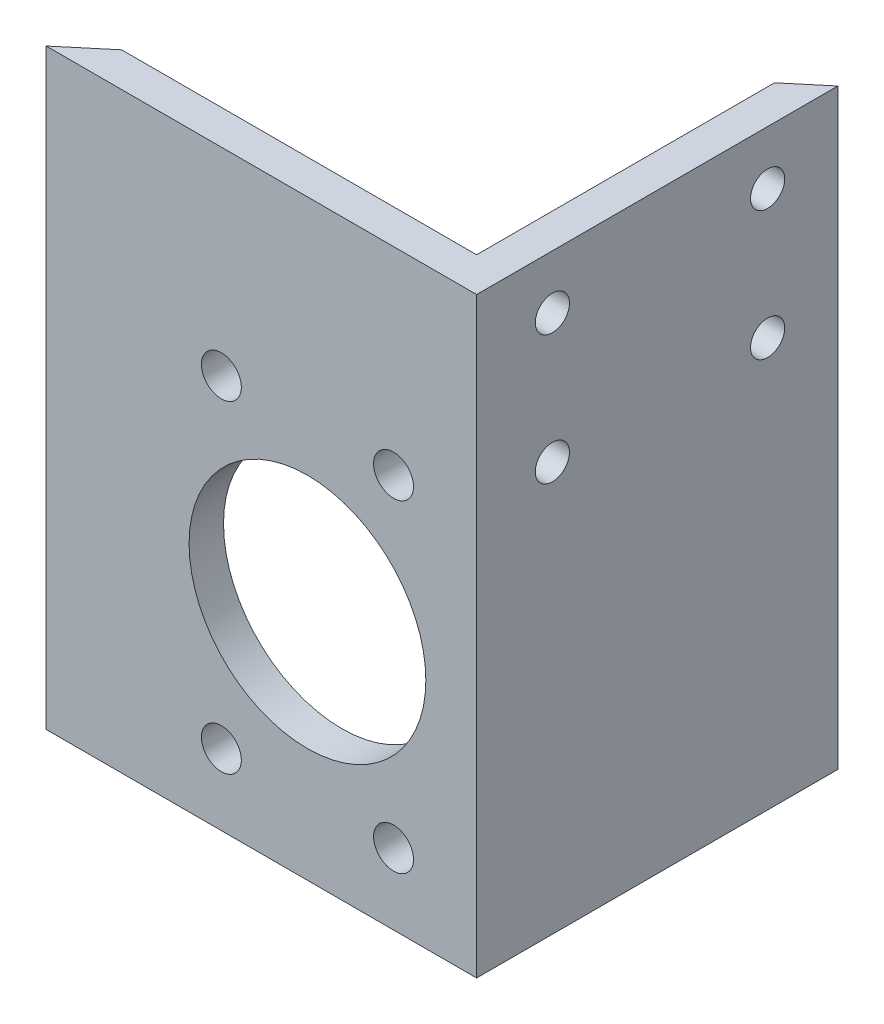
ISO-10303-21;
HEADER;
FILE_DESCRIPTION(('STEP AP214'),'2;1');
FILE_NAME('part.step','',(''),(''),'','','');
FILE_SCHEMA(('AUTOMOTIVE_DESIGN { 1 0 10303 214 1 1 1 1 }'));
ENDSEC;
DATA;
#1=APPLICATION_CONTEXT('core data for automotive mechanical design processes');
#2=APPLICATION_PROTOCOL_DEFINITION('international standard','automotive_design',2000,#1);
#3=PRODUCT_CONTEXT('',#1,'mechanical');
#4=PRODUCT('Part','Part','',(#3));
#5=PRODUCT_RELATED_PRODUCT_CATEGORY('part','',(#4));
#6=PRODUCT_DEFINITION_FORMATION('','',#4);
#7=PRODUCT_DEFINITION_CONTEXT('part definition',#1,'design');
#8=PRODUCT_DEFINITION('design','',#6,#7);
#9=PRODUCT_DEFINITION_SHAPE('','',#8);
#10=(LENGTH_UNIT() NAMED_UNIT(*) SI_UNIT(.MILLI.,.METRE.));
#11=(NAMED_UNIT(*) PLANE_ANGLE_UNIT() SI_UNIT($,.RADIAN.));
#12=(NAMED_UNIT(*) SI_UNIT($,.STERADIAN.) SOLID_ANGLE_UNIT());
#13=UNCERTAINTY_MEASURE_WITH_UNIT(LENGTH_MEASURE(1.E-05),#10,'distance_accuracy_value','');
#14=(GEOMETRIC_REPRESENTATION_CONTEXT(3) GLOBAL_UNCERTAINTY_ASSIGNED_CONTEXT((#13)) GLOBAL_UNIT_ASSIGNED_CONTEXT((#10,
#11,#12)) REPRESENTATION_CONTEXT('',''));
#15=CARTESIAN_POINT('',(0.,0.,0.));
#16=DIRECTION('',(0.,0.,1.));
#17=DIRECTION('',(1.,0.,0.));
#18=AXIS2_PLACEMENT_3D('',#15,#16,#17);
#19=CARTESIAN_POINT('',(4.84328660030284,69.85,-4.06399999999999));
#20=DIRECTION('',(0.642787609686541,0.,0.766044443118977));
#21=DIRECTION('',(0.766044443118977,0.,-0.642787609686541));
#22=AXIS2_PLACEMENT_3D('',#19,#20,#21);
#23=PLANE('',#22);
#24=DIRECTION('',(-0.766044443118977,0.,0.642787609686541));
#25=VECTOR('',#24,1.);
#26=CARTESIAN_POINT('',(4.84328660030284,0.,-4.06399999999999));
#27=LINE('',#26,#25);
#28=CARTESIAN_POINT('',(4.84328660030284,0.,-4.06399999999999));
#29=VERTEX_POINT('',#28);
#30=CARTESIAN_POINT('',(0.,0.,0.));
#31=VERTEX_POINT('',#30);
#32=EDGE_CURVE('E116',#29,#31,#27,.T.);
#33=ORIENTED_EDGE('',*,*,#32,.T.);
#34=DIRECTION('',(0.,-1.,0.));
#35=VECTOR('',#34,1.);
#36=CARTESIAN_POINT('',(0.,69.85,0.));
#37=LINE('',#36,#35);
#38=CARTESIAN_POINT('',(0.,69.85,0.));
#39=VERTEX_POINT('',#38);
#40=EDGE_CURVE('E11',#39,#31,#37,.T.);
#41=ORIENTED_EDGE('',*,*,#40,.F.);
#42=DIRECTION('',(-0.766044443118977,0.,0.642787609686541));
#43=VECTOR('',#42,1.);
#44=CARTESIAN_POINT('',(4.84328660030284,69.85,-4.06399999999999));
#45=LINE('',#44,#43);
#46=CARTESIAN_POINT('',(4.84328660030284,69.85,-4.06399999999999));
#47=VERTEX_POINT('',#46);
#48=EDGE_CURVE('E127',#47,#39,#45,.T.);
#49=ORIENTED_EDGE('',*,*,#48,.F.);
#50=DIRECTION('',(0.,-1.,0.));
#51=VECTOR('',#50,1.);
#52=CARTESIAN_POINT('',(4.84328660030284,69.85,-4.06399999999999));
#53=LINE('',#52,#51);
#54=EDGE_CURVE('E112',#47,#29,#53,.T.);
#55=ORIENTED_EDGE('',*,*,#54,.T.);
#56=EDGE_LOOP('',(#33,#41,#49,#55));
#57=FACE_BOUND('',#56,.T.);
#58=ADVANCED_FACE('F32',(#57),#23,.F.);
#59=CARTESIAN_POINT('',(0.,69.85,0.));
#60=DIRECTION('',(0.,0.,-1.));
#61=DIRECTION('',(-1.,0.,0.));
#62=AXIS2_PLACEMENT_3D('',#59,#60,#61);
#63=PLANE('',#62);
#64=CARTESIAN_POINT('',(30.8356,27.432,0.));
#65=DIRECTION('',(0.,0.,-1.));
#66=DIRECTION('',(-1.,0.,0.));
#67=AXIS2_PLACEMENT_3D('',#64,#65,#66);
#68=CIRCLE('',#67,13.97);
#69=CARTESIAN_POINT('',(16.8656,27.432,0.));
#70=VERTEX_POINT('',#69);
#71=EDGE_CURVE('E297',#70,#70,#68,.T.);
#72=ORIENTED_EDGE('',*,*,#71,.T.);
#73=EDGE_LOOP('',(#72));
#74=FACE_BOUND('',#73,.T.);
#75=CARTESIAN_POINT('',(40.9956,8.38200000000001,0.));
#76=DIRECTION('',(0.,0.,-1.));
#77=DIRECTION('',(-1.,0.,0.));
#78=AXIS2_PLACEMENT_3D('',#75,#76,#77);
#79=CIRCLE('',#78,2.35585);
#80=CARTESIAN_POINT('',(38.63975,8.38200000000001,0.));
#81=VERTEX_POINT('',#80);
#82=EDGE_CURVE('E304',#81,#81,#79,.T.);
#83=ORIENTED_EDGE('',*,*,#82,.T.);
#84=EDGE_LOOP('',(#83));
#85=FACE_BOUND('',#84,.T.);
#86=CARTESIAN_POINT('',(20.6756,8.38200000000001,0.));
#87=DIRECTION('',(0.,0.,-1.));
#88=DIRECTION('',(-1.,0.,0.));
#89=AXIS2_PLACEMENT_3D('',#86,#87,#88);
#90=CIRCLE('',#89,2.35585);
#91=CARTESIAN_POINT('',(18.31975,8.38200000000001,0.));
#92=VERTEX_POINT('',#91);
#93=EDGE_CURVE('E310',#92,#92,#90,.T.);
#94=ORIENTED_EDGE('',*,*,#93,.T.);
#95=EDGE_LOOP('',(#94));
#96=FACE_BOUND('',#95,.T.);
#97=CARTESIAN_POINT('',(20.6756,46.482,0.));
#98=DIRECTION('',(0.,0.,-1.));
#99=DIRECTION('',(-1.,0.,0.));
#100=AXIS2_PLACEMENT_3D('',#97,#98,#99);
#101=CIRCLE('',#100,2.35585);
#102=CARTESIAN_POINT('',(18.31975,46.482,0.));
#103=VERTEX_POINT('',#102);
#104=EDGE_CURVE('E316',#103,#103,#101,.T.);
#105=ORIENTED_EDGE('',*,*,#104,.T.);
#106=EDGE_LOOP('',(#105));
#107=FACE_BOUND('',#106,.T.);
#108=CARTESIAN_POINT('',(40.9956,46.482,0.));
#109=DIRECTION('',(0.,0.,-1.));
#110=DIRECTION('',(-1.,0.,0.));
#111=AXIS2_PLACEMENT_3D('',#108,#109,#110);
#112=CIRCLE('',#111,2.35585);
#113=CARTESIAN_POINT('',(38.63975,46.482,0.));
#114=VERTEX_POINT('',#113);
#115=EDGE_CURVE('E322',#114,#114,#112,.T.);
#116=ORIENTED_EDGE('',*,*,#115,.T.);
#117=EDGE_LOOP('',(#116));
#118=FACE_BOUND('',#117,.T.);
#119=DIRECTION('',(1.,0.,0.));
#120=VECTOR('',#119,1.);
#121=CARTESIAN_POINT('',(0.,0.,0.));
#122=LINE('',#121,#120);
#123=CARTESIAN_POINT('',(50.8,0.,0.));
#124=VERTEX_POINT('',#123);
#125=EDGE_CURVE('E119',#31,#124,#122,.T.);
#126=ORIENTED_EDGE('',*,*,#125,.T.);
#127=DIRECTION('',(0.,-1.,0.));
#128=VECTOR('',#127,1.);
#129=CARTESIAN_POINT('',(50.8,69.85,0.));
#130=LINE('',#129,#128);
#131=CARTESIAN_POINT('',(50.8,69.85,0.));
#132=VERTEX_POINT('',#131);
#133=EDGE_CURVE('E40',#132,#124,#130,.T.);
#134=ORIENTED_EDGE('',*,*,#133,.F.);
#135=DIRECTION('',(1.,0.,0.));
#136=VECTOR('',#135,1.);
#137=CARTESIAN_POINT('',(0.,69.85,0.));
#138=LINE('',#137,#136);
#139=EDGE_CURVE('E85',#39,#132,#138,.T.);
#140=ORIENTED_EDGE('',*,*,#139,.F.);
#141=ORIENTED_EDGE('',*,*,#40,.T.);
#142=EDGE_LOOP('',(#126,#134,#140,#141));
#143=FACE_BOUND('',#142,.T.);
#144=ADVANCED_FACE('F155',(#74,#85,#96,#107,#118,#143),#63,.F.);
#145=CARTESIAN_POINT('',(50.8,69.85,0.));
#146=DIRECTION('',(-1.,0.,0.));
#147=DIRECTION('',(0.,0.,1.));
#148=AXIS2_PLACEMENT_3D('',#145,#146,#147);
#149=PLANE('',#148);
#150=CARTESIAN_POINT('',(50.8,48.26,-34.3400801813508));
#151=DIRECTION('',(-1.,0.,0.));
#152=DIRECTION('',(0.,0.,1.));
#153=AXIS2_PLACEMENT_3D('',#150,#151,#152);
#154=CIRCLE('',#153,2.0193);
#155=CARTESIAN_POINT('',(50.8,48.26,-32.3207801813508));
#156=VERTEX_POINT('',#155);
#157=EDGE_CURVE('E328',#156,#156,#154,.T.);
#158=ORIENTED_EDGE('',*,*,#157,.T.);
#159=EDGE_LOOP('',(#158));
#160=FACE_BOUND('',#159,.T.);
#161=CARTESIAN_POINT('',(50.8,48.26,-8.94008018135078));
#162=DIRECTION('',(-1.,0.,0.));
#163=DIRECTION('',(0.,0.,1.));
#164=AXIS2_PLACEMENT_3D('',#161,#162,#163);
#165=CIRCLE('',#164,2.0193);
#166=CARTESIAN_POINT('',(50.8,48.26,-6.92078018135078));
#167=VERTEX_POINT('',#166);
#168=EDGE_CURVE('E334',#167,#167,#165,.T.);
#169=ORIENTED_EDGE('',*,*,#168,.T.);
#170=EDGE_LOOP('',(#169));
#171=FACE_BOUND('',#170,.T.);
#172=CARTESIAN_POINT('',(50.8,63.5,-8.94008018135078));
#173=DIRECTION('',(-1.,0.,0.));
#174=DIRECTION('',(0.,0.,1.));
#175=AXIS2_PLACEMENT_3D('',#172,#173,#174);
#176=CIRCLE('',#175,2.0193);
#177=CARTESIAN_POINT('',(50.8,63.5,-6.92078018135078));
#178=VERTEX_POINT('',#177);
#179=EDGE_CURVE('E340',#178,#178,#176,.T.);
#180=ORIENTED_EDGE('',*,*,#179,.T.);
#181=EDGE_LOOP('',(#180));
#182=FACE_BOUND('',#181,.T.);
#183=CARTESIAN_POINT('',(50.8,63.5,-34.3400801813508));
#184=DIRECTION('',(-1.,0.,0.));
#185=DIRECTION('',(0.,0.,1.));
#186=AXIS2_PLACEMENT_3D('',#183,#184,#185);
#187=CIRCLE('',#186,2.0193);
#188=CARTESIAN_POINT('',(50.8,63.5,-32.3207801813508));
#189=VERTEX_POINT('',#188);
#190=EDGE_CURVE('E120',#189,#189,#187,.T.);
#191=ORIENTED_EDGE('',*,*,#190,.T.);
#192=EDGE_LOOP('',(#191));
#193=FACE_BOUND('',#192,.T.);
#194=DIRECTION('',(0.,0.,-1.));
#195=VECTOR('',#194,1.);
#196=CARTESIAN_POINT('',(50.8,0.,0.));
#197=LINE('',#196,#195);
#198=CARTESIAN_POINT('',(50.8,0.,-42.626261263806));
#199=VERTEX_POINT('',#198);
#200=EDGE_CURVE('E122',#124,#199,#197,.T.);
#201=ORIENTED_EDGE('',*,*,#200,.T.);
#202=DIRECTION('',(0.,-1.,0.));
#203=VECTOR('',#202,1.);
#204=CARTESIAN_POINT('',(50.8,69.85,-42.626261263806));
#205=LINE('',#204,#203);
#206=CARTESIAN_POINT('',(50.8,69.85,-42.626261263806));
#207=VERTEX_POINT('',#206);
#208=EDGE_CURVE('E107',#207,#199,#205,.T.);
#209=ORIENTED_EDGE('',*,*,#208,.F.);
#210=DIRECTION('',(0.,0.,-1.));
#211=VECTOR('',#210,1.);
#212=CARTESIAN_POINT('',(50.8,69.85,0.));
#213=LINE('',#212,#211);
#214=EDGE_CURVE('E98',#132,#207,#213,.T.);
#215=ORIENTED_EDGE('',*,*,#214,.F.);
#216=ORIENTED_EDGE('',*,*,#133,.T.);
#217=EDGE_LOOP('',(#201,#209,#215,#216));
#218=FACE_BOUND('',#217,.T.);
#219=ADVANCED_FACE('F133',(#160,#171,#182,#193,#218),#149,.F.);
#220=CARTESIAN_POINT('',(50.8,69.85,-42.626261263806));
#221=DIRECTION('',(0.64278760968654,0.,0.766044443118978));
#222=DIRECTION('',(0.766044443118978,0.,-0.64278760968654));
#223=AXIS2_PLACEMENT_3D('',#220,#221,#222);
#224=PLANE('',#223);
#225=DIRECTION('',(-0.766044443118978,0.,0.64278760968654));
#226=VECTOR('',#225,1.);
#227=CARTESIAN_POINT('',(50.8,0.,-42.626261263806));
#228=LINE('',#227,#226);
#229=CARTESIAN_POINT('',(46.736,0.,-39.2161603627015));
#230=VERTEX_POINT('',#229);
#231=EDGE_CURVE('E106',#199,#230,#228,.T.);
#232=ORIENTED_EDGE('',*,*,#231,.T.);
#233=DIRECTION('',(0.,-1.,0.));
#234=VECTOR('',#233,1.);
#235=CARTESIAN_POINT('',(46.736,69.85,-39.2161603627015));
#236=LINE('',#235,#234);
#237=CARTESIAN_POINT('',(46.736,69.85,-39.2161603627015));
#238=VERTEX_POINT('',#237);
#239=EDGE_CURVE('E103',#238,#230,#236,.T.);
#240=ORIENTED_EDGE('',*,*,#239,.F.);
#241=DIRECTION('',(-0.766044443118978,0.,0.64278760968654));
#242=VECTOR('',#241,1.);
#243=CARTESIAN_POINT('',(50.8,69.85,-42.626261263806));
#244=LINE('',#243,#242);
#245=EDGE_CURVE('E92',#207,#238,#244,.T.);
#246=ORIENTED_EDGE('',*,*,#245,.F.);
#247=ORIENTED_EDGE('',*,*,#208,.T.);
#248=EDGE_LOOP('',(#232,#240,#246,#247));
#249=FACE_BOUND('',#248,.T.);
#250=ADVANCED_FACE('F104',(#249),#224,.F.);
#251=CARTESIAN_POINT('',(46.736,69.85,-39.2161603627015));
#252=DIRECTION('',(1.,0.,0.));
#253=DIRECTION('',(0.,0.,-1.));
#254=AXIS2_PLACEMENT_3D('',#251,#252,#253);
#255=PLANE('',#254);
#256=CARTESIAN_POINT('',(46.736,48.26,-34.3400801813508));
#257=DIRECTION('',(-1.,0.,0.));
#258=DIRECTION('',(0.,0.,1.));
#259=AXIS2_PLACEMENT_3D('',#256,#257,#258);
#260=CIRCLE('',#259,2.0193);
#261=CARTESIAN_POINT('',(46.736,48.26,-32.3207801813508));
#262=VERTEX_POINT('',#261);
#263=EDGE_CURVE('E325',#262,#262,#260,.T.);
#264=ORIENTED_EDGE('',*,*,#263,.F.);
#265=EDGE_LOOP('',(#264));
#266=FACE_BOUND('',#265,.T.);
#267=CARTESIAN_POINT('',(46.736,48.26,-8.94008018135078));
#268=DIRECTION('',(-1.,0.,0.));
#269=DIRECTION('',(0.,0.,1.));
#270=AXIS2_PLACEMENT_3D('',#267,#268,#269);
#271=CIRCLE('',#270,2.0193);
#272=CARTESIAN_POINT('',(46.736,48.26,-6.92078018135078));
#273=VERTEX_POINT('',#272);
#274=EDGE_CURVE('E331',#273,#273,#271,.T.);
#275=ORIENTED_EDGE('',*,*,#274,.F.);
#276=EDGE_LOOP('',(#275));
#277=FACE_BOUND('',#276,.T.);
#278=CARTESIAN_POINT('',(46.736,63.5,-8.94008018135078));
#279=DIRECTION('',(-1.,0.,0.));
#280=DIRECTION('',(0.,0.,1.));
#281=AXIS2_PLACEMENT_3D('',#278,#279,#280);
#282=CIRCLE('',#281,2.0193);
#283=CARTESIAN_POINT('',(46.736,63.5,-6.92078018135078));
#284=VERTEX_POINT('',#283);
#285=EDGE_CURVE('E337',#284,#284,#282,.T.);
#286=ORIENTED_EDGE('',*,*,#285,.F.);
#287=EDGE_LOOP('',(#286));
#288=FACE_BOUND('',#287,.T.);
#289=CARTESIAN_POINT('',(46.736,63.5,-34.3400801813508));
#290=DIRECTION('',(-1.,0.,0.));
#291=DIRECTION('',(0.,0.,1.));
#292=AXIS2_PLACEMENT_3D('',#289,#290,#291);
#293=CIRCLE('',#292,2.0193);
#294=CARTESIAN_POINT('',(46.736,63.5,-32.3207801813508));
#295=VERTEX_POINT('',#294);
#296=EDGE_CURVE('E343',#295,#295,#293,.T.);
#297=ORIENTED_EDGE('',*,*,#296,.F.);
#298=EDGE_LOOP('',(#297));
#299=FACE_BOUND('',#298,.T.);
#300=DIRECTION('',(0.,0.,1.));
#301=VECTOR('',#300,1.);
#302=CARTESIAN_POINT('',(46.736,0.,-39.2161603627015));
#303=LINE('',#302,#301);
#304=CARTESIAN_POINT('',(46.736,0.,-4.064));
#305=VERTEX_POINT('',#304);
#306=EDGE_CURVE('E71',#230,#305,#303,.T.);
#307=ORIENTED_EDGE('',*,*,#306,.T.);
#308=DIRECTION('',(0.,-1.,0.));
#309=VECTOR('',#308,1.);
#310=CARTESIAN_POINT('',(46.736,69.85,-4.064));
#311=LINE('',#310,#309);
#312=CARTESIAN_POINT('',(46.736,69.85,-4.064));
#313=VERTEX_POINT('',#312);
#314=EDGE_CURVE('E108',#313,#305,#311,.T.);
#315=ORIENTED_EDGE('',*,*,#314,.F.);
#316=DIRECTION('',(0.,0.,1.));
#317=VECTOR('',#316,1.);
#318=CARTESIAN_POINT('',(46.736,69.85,-39.2161603627015));
#319=LINE('',#318,#317);
#320=EDGE_CURVE('E96',#238,#313,#319,.T.);
#321=ORIENTED_EDGE('',*,*,#320,.F.);
#322=ORIENTED_EDGE('',*,*,#239,.T.);
#323=EDGE_LOOP('',(#307,#315,#321,#322));
#324=FACE_BOUND('',#323,.T.);
#325=ADVANCED_FACE('F110',(#266,#277,#288,#299,#324),#255,.F.);
#326=CARTESIAN_POINT('',(46.736,69.85,-4.064));
#327=DIRECTION('',(0.,0.,1.));
#328=DIRECTION('',(1.,0.,0.));
#329=AXIS2_PLACEMENT_3D('',#326,#327,#328);
#330=PLANE('',#329);
#331=CARTESIAN_POINT('',(30.8356,27.432,-4.064));
#332=DIRECTION('',(0.,0.,-1.));
#333=DIRECTION('',(-1.,0.,0.));
#334=AXIS2_PLACEMENT_3D('',#331,#332,#333);
#335=CIRCLE('',#334,13.97);
#336=CARTESIAN_POINT('',(16.8656,27.432,-4.064));
#337=VERTEX_POINT('',#336);
#338=EDGE_CURVE('E299',#337,#337,#335,.T.);
#339=ORIENTED_EDGE('',*,*,#338,.F.);
#340=EDGE_LOOP('',(#339));
#341=FACE_BOUND('',#340,.T.);
#342=CARTESIAN_POINT('',(40.9956,8.38200000000001,-4.064));
#343=DIRECTION('',(0.,0.,-1.));
#344=DIRECTION('',(-1.,0.,0.));
#345=AXIS2_PLACEMENT_3D('',#342,#343,#344);
#346=CIRCLE('',#345,2.35585);
#347=CARTESIAN_POINT('',(38.63975,8.38200000000001,-4.064));
#348=VERTEX_POINT('',#347);
#349=EDGE_CURVE('E301',#348,#348,#346,.T.);
#350=ORIENTED_EDGE('',*,*,#349,.F.);
#351=EDGE_LOOP('',(#350));
#352=FACE_BOUND('',#351,.T.);
#353=CARTESIAN_POINT('',(20.6756,8.38200000000001,-4.064));
#354=DIRECTION('',(0.,0.,-1.));
#355=DIRECTION('',(-1.,0.,0.));
#356=AXIS2_PLACEMENT_3D('',#353,#354,#355);
#357=CIRCLE('',#356,2.35585);
#358=CARTESIAN_POINT('',(18.31975,8.38200000000001,-4.064));
#359=VERTEX_POINT('',#358);
#360=EDGE_CURVE('E307',#359,#359,#357,.T.);
#361=ORIENTED_EDGE('',*,*,#360,.F.);
#362=EDGE_LOOP('',(#361));
#363=FACE_BOUND('',#362,.T.);
#364=CARTESIAN_POINT('',(20.6756,46.482,-4.064));
#365=DIRECTION('',(0.,0.,-1.));
#366=DIRECTION('',(-1.,0.,0.));
#367=AXIS2_PLACEMENT_3D('',#364,#365,#366);
#368=CIRCLE('',#367,2.35585);
#369=CARTESIAN_POINT('',(18.31975,46.482,-4.064));
#370=VERTEX_POINT('',#369);
#371=EDGE_CURVE('E313',#370,#370,#368,.T.);
#372=ORIENTED_EDGE('',*,*,#371,.F.);
#373=EDGE_LOOP('',(#372));
#374=FACE_BOUND('',#373,.T.);
#375=CARTESIAN_POINT('',(40.9956,46.482,-4.064));
#376=DIRECTION('',(0.,0.,-1.));
#377=DIRECTION('',(-1.,0.,0.));
#378=AXIS2_PLACEMENT_3D('',#375,#376,#377);
#379=CIRCLE('',#378,2.35585);
#380=CARTESIAN_POINT('',(38.63975,46.482,-4.064));
#381=VERTEX_POINT('',#380);
#382=EDGE_CURVE('E319',#381,#381,#379,.T.);
#383=ORIENTED_EDGE('',*,*,#382,.F.);
#384=EDGE_LOOP('',(#383));
#385=FACE_BOUND('',#384,.T.);
#386=DIRECTION('',(-1.,0.,0.));
#387=VECTOR('',#386,1.);
#388=CARTESIAN_POINT('',(46.736,0.,-4.064));
#389=LINE('',#388,#387);
#390=EDGE_CURVE('E77',#305,#29,#389,.T.);
#391=ORIENTED_EDGE('',*,*,#390,.T.);
#392=ORIENTED_EDGE('',*,*,#54,.F.);
#393=DIRECTION('',(-1.,0.,0.));
#394=VECTOR('',#393,1.);
#395=CARTESIAN_POINT('',(46.736,69.85,-4.064));
#396=LINE('',#395,#394);
#397=EDGE_CURVE('E48',#313,#47,#396,.T.);
#398=ORIENTED_EDGE('',*,*,#397,.F.);
#399=ORIENTED_EDGE('',*,*,#314,.T.);
#400=EDGE_LOOP('',(#391,#392,#398,#399));
#401=FACE_BOUND('',#400,.T.);
#402=ADVANCED_FACE('F140',(#341,#352,#363,#374,#385,#401),#330,.F.);
#403=CARTESIAN_POINT('',(0.,69.85,0.));
#404=DIRECTION('',(0.,-1.,0.));
#405=DIRECTION('',(0.,0.,-1.));
#406=AXIS2_PLACEMENT_3D('',#403,#404,#405);
#407=PLANE('',#406);
#408=ORIENTED_EDGE('',*,*,#48,.T.);
#409=ORIENTED_EDGE('',*,*,#139,.T.);
#410=ORIENTED_EDGE('',*,*,#214,.T.);
#411=ORIENTED_EDGE('',*,*,#245,.T.);
#412=ORIENTED_EDGE('',*,*,#320,.T.);
#413=ORIENTED_EDGE('',*,*,#397,.T.);
#414=EDGE_LOOP('',(#408,#409,#410,#411,#412,#413));
#415=FACE_BOUND('',#414,.T.);
#416=ADVANCED_FACE('F94',(#415),#407,.F.);
#417=CARTESIAN_POINT('',(0.,0.,0.));
#418=DIRECTION('',(0.,-1.,0.));
#419=DIRECTION('',(0.,0.,-1.));
#420=AXIS2_PLACEMENT_3D('',#417,#418,#419);
#421=PLANE('',#420);
#422=ORIENTED_EDGE('',*,*,#32,.F.);
#423=ORIENTED_EDGE('',*,*,#390,.F.);
#424=ORIENTED_EDGE('',*,*,#306,.F.);
#425=ORIENTED_EDGE('',*,*,#231,.F.);
#426=ORIENTED_EDGE('',*,*,#200,.F.);
#427=ORIENTED_EDGE('',*,*,#125,.F.);
#428=EDGE_LOOP('',(#422,#423,#424,#425,#426,#427));
#429=FACE_BOUND('',#428,.T.);
#430=ADVANCED_FACE('F136',(#429),#421,.T.);
#431=CARTESIAN_POINT('',(50.8,63.5,-34.3400801813508));
#432=DIRECTION('',(-1.,0.,0.));
#433=DIRECTION('',(0.,0.,1.));
#434=AXIS2_PLACEMENT_3D('',#431,#432,#433);
#435=CYLINDRICAL_SURFACE('',#434,2.0193);
#436=ORIENTED_EDGE('',*,*,#190,.F.);
#437=EDGE_LOOP('',(#436));
#438=FACE_BOUND('',#437,.T.);
#439=ORIENTED_EDGE('',*,*,#296,.T.);
#440=EDGE_LOOP('',(#439));
#441=FACE_BOUND('',#440,.T.);
#442=ADVANCED_FACE('F187',(#438,#441),#435,.F.);
#443=CARTESIAN_POINT('',(50.8,63.5,-8.94008018135078));
#444=DIRECTION('',(-1.,0.,0.));
#445=DIRECTION('',(0.,0.,1.));
#446=AXIS2_PLACEMENT_3D('',#443,#444,#445);
#447=CYLINDRICAL_SURFACE('',#446,2.0193);
#448=ORIENTED_EDGE('',*,*,#179,.F.);
#449=EDGE_LOOP('',(#448));
#450=FACE_BOUND('',#449,.T.);
#451=ORIENTED_EDGE('',*,*,#285,.T.);
#452=EDGE_LOOP('',(#451));
#453=FACE_BOUND('',#452,.T.);
#454=ADVANCED_FACE('F192',(#450,#453),#447,.F.);
#455=CARTESIAN_POINT('',(50.8,48.26,-8.94008018135078));
#456=DIRECTION('',(-1.,0.,0.));
#457=DIRECTION('',(0.,0.,1.));
#458=AXIS2_PLACEMENT_3D('',#455,#456,#457);
#459=CYLINDRICAL_SURFACE('',#458,2.0193);
#460=ORIENTED_EDGE('',*,*,#168,.F.);
#461=EDGE_LOOP('',(#460));
#462=FACE_BOUND('',#461,.T.);
#463=ORIENTED_EDGE('',*,*,#274,.T.);
#464=EDGE_LOOP('',(#463));
#465=FACE_BOUND('',#464,.T.);
#466=ADVANCED_FACE('F204',(#462,#465),#459,.F.);
#467=CARTESIAN_POINT('',(50.8,48.26,-34.3400801813508));
#468=DIRECTION('',(-1.,0.,0.));
#469=DIRECTION('',(0.,0.,1.));
#470=AXIS2_PLACEMENT_3D('',#467,#468,#469);
#471=CYLINDRICAL_SURFACE('',#470,2.0193);
#472=ORIENTED_EDGE('',*,*,#157,.F.);
#473=EDGE_LOOP('',(#472));
#474=FACE_BOUND('',#473,.T.);
#475=ORIENTED_EDGE('',*,*,#263,.T.);
#476=EDGE_LOOP('',(#475));
#477=FACE_BOUND('',#476,.T.);
#478=ADVANCED_FACE('F214',(#474,#477),#471,.F.);
#479=CARTESIAN_POINT('',(40.9956,46.482,0.));
#480=DIRECTION('',(0.,0.,-1.));
#481=DIRECTION('',(-1.,0.,0.));
#482=AXIS2_PLACEMENT_3D('',#479,#480,#481);
#483=CYLINDRICAL_SURFACE('',#482,2.35585);
#484=ORIENTED_EDGE('',*,*,#115,.F.);
#485=EDGE_LOOP('',(#484));
#486=FACE_BOUND('',#485,.T.);
#487=ORIENTED_EDGE('',*,*,#382,.T.);
#488=EDGE_LOOP('',(#487));
#489=FACE_BOUND('',#488,.T.);
#490=ADVANCED_FACE('F223',(#486,#489),#483,.F.);
#491=CARTESIAN_POINT('',(20.6756,46.482,0.));
#492=DIRECTION('',(0.,0.,-1.));
#493=DIRECTION('',(-1.,0.,0.));
#494=AXIS2_PLACEMENT_3D('',#491,#492,#493);
#495=CYLINDRICAL_SURFACE('',#494,2.35585);
#496=ORIENTED_EDGE('',*,*,#104,.F.);
#497=EDGE_LOOP('',(#496));
#498=FACE_BOUND('',#497,.T.);
#499=ORIENTED_EDGE('',*,*,#371,.T.);
#500=EDGE_LOOP('',(#499));
#501=FACE_BOUND('',#500,.T.);
#502=ADVANCED_FACE('F243',(#498,#501),#495,.F.);
#503=CARTESIAN_POINT('',(20.6756,8.38200000000001,0.));
#504=DIRECTION('',(0.,0.,-1.));
#505=DIRECTION('',(-1.,0.,0.));
#506=AXIS2_PLACEMENT_3D('',#503,#504,#505);
#507=CYLINDRICAL_SURFACE('',#506,2.35585);
#508=ORIENTED_EDGE('',*,*,#93,.F.);
#509=EDGE_LOOP('',(#508));
#510=FACE_BOUND('',#509,.T.);
#511=ORIENTED_EDGE('',*,*,#360,.T.);
#512=EDGE_LOOP('',(#511));
#513=FACE_BOUND('',#512,.T.);
#514=ADVANCED_FACE('F253',(#510,#513),#507,.F.);
#515=CARTESIAN_POINT('',(40.9956,8.38200000000001,0.));
#516=DIRECTION('',(0.,0.,-1.));
#517=DIRECTION('',(-1.,0.,0.));
#518=AXIS2_PLACEMENT_3D('',#515,#516,#517);
#519=CYLINDRICAL_SURFACE('',#518,2.35585);
#520=ORIENTED_EDGE('',*,*,#82,.F.);
#521=EDGE_LOOP('',(#520));
#522=FACE_BOUND('',#521,.T.);
#523=ORIENTED_EDGE('',*,*,#349,.T.);
#524=EDGE_LOOP('',(#523));
#525=FACE_BOUND('',#524,.T.);
#526=ADVANCED_FACE('F263',(#522,#525),#519,.F.);
#527=CARTESIAN_POINT('',(30.8356,27.432,0.));
#528=DIRECTION('',(0.,0.,-1.));
#529=DIRECTION('',(-1.,0.,0.));
#530=AXIS2_PLACEMENT_3D('',#527,#528,#529);
#531=CYLINDRICAL_SURFACE('',#530,13.97);
#532=ORIENTED_EDGE('',*,*,#71,.F.);
#533=EDGE_LOOP('',(#532));
#534=FACE_BOUND('',#533,.T.);
#535=ORIENTED_EDGE('',*,*,#338,.T.);
#536=EDGE_LOOP('',(#535));
#537=FACE_BOUND('',#536,.T.);
#538=ADVANCED_FACE('F273',(#534,#537),#531,.F.);
#539=CLOSED_SHELL('',(#58,#144,#219,#250,#325,#402,#416,#430,#442,#454,#466,#478,#490,#502,#514,
#526,#538));
#540=MANIFOLD_SOLID_BREP('B2',#539);
#541=ADVANCED_BREP_SHAPE_REPRESENTATION('',(#18,#540),#14);
#542=SHAPE_DEFINITION_REPRESENTATION(#9,#541);
ENDSEC;
END-ISO-10303-21;
